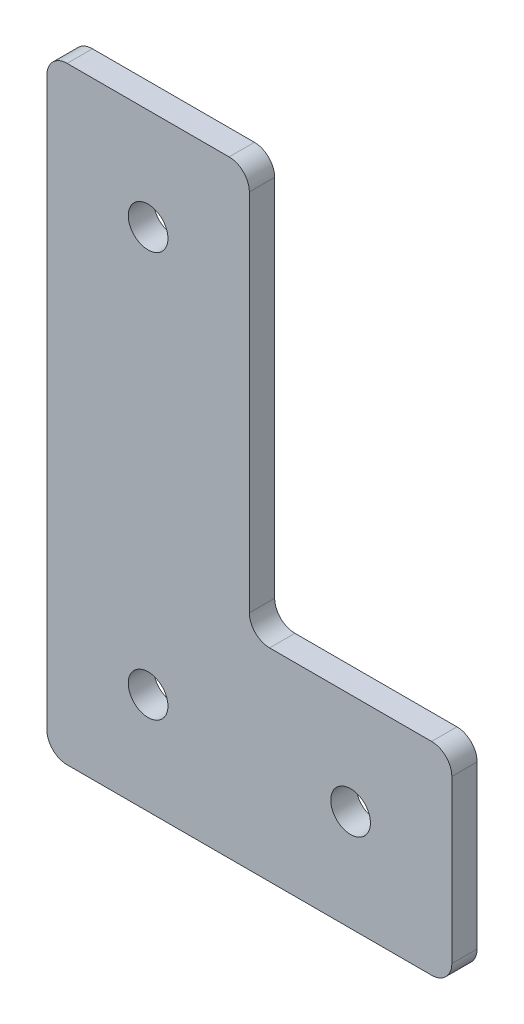
ISO-10303-21;
HEADER;
FILE_DESCRIPTION(('STEP AP214'),'2;1');
FILE_NAME('part.step','',(''),(''),'','','');
FILE_SCHEMA(('AUTOMOTIVE_DESIGN { 1 0 10303 214 1 1 1 1 }'));
ENDSEC;
DATA;
#1=APPLICATION_CONTEXT('core data for automotive mechanical design processes');
#2=APPLICATION_PROTOCOL_DEFINITION('international standard','automotive_design',2000,#1);
#3=PRODUCT_CONTEXT('',#1,'mechanical');
#4=PRODUCT('Part','Part','',(#3));
#5=PRODUCT_RELATED_PRODUCT_CATEGORY('part','',(#4));
#6=PRODUCT_DEFINITION_FORMATION('','',#4);
#7=PRODUCT_DEFINITION_CONTEXT('part definition',#1,'design');
#8=PRODUCT_DEFINITION('design','',#6,#7);
#9=PRODUCT_DEFINITION_SHAPE('','',#8);
#10=(LENGTH_UNIT() NAMED_UNIT(*) SI_UNIT(.MILLI.,.METRE.));
#11=(NAMED_UNIT(*) PLANE_ANGLE_UNIT() SI_UNIT($,.RADIAN.));
#12=(NAMED_UNIT(*) SI_UNIT($,.STERADIAN.) SOLID_ANGLE_UNIT());
#13=UNCERTAINTY_MEASURE_WITH_UNIT(LENGTH_MEASURE(1.E-05),#10,'distance_accuracy_value','');
#14=(GEOMETRIC_REPRESENTATION_CONTEXT(3) GLOBAL_UNCERTAINTY_ASSIGNED_CONTEXT((#13)) GLOBAL_UNIT_ASSIGNED_CONTEXT((#10,
#11,#12)) REPRESENTATION_CONTEXT('',''));
#15=CARTESIAN_POINT('',(0.,0.,0.));
#16=DIRECTION('',(0.,0.,1.));
#17=DIRECTION('',(1.,0.,0.));
#18=AXIS2_PLACEMENT_3D('',#15,#16,#17);
#19=CARTESIAN_POINT('',(48.26,2.54,3.175));
#20=DIRECTION('',(0.,0.,1.));
#21=DIRECTION('',(1.,0.,0.));
#22=AXIS2_PLACEMENT_3D('',#19,#20,#21);
#23=PLANE('',#22);
#24=CARTESIAN_POINT('',(12.7,12.7,3.175));
#25=DIRECTION('',(0.,0.,1.));
#26=DIRECTION('',(1.,0.,0.));
#27=AXIS2_PLACEMENT_3D('',#24,#25,#26);
#28=CIRCLE('',#27,2.4892);
#29=CARTESIAN_POINT('',(15.1892,12.7,3.175));
#30=VERTEX_POINT('',#29);
#31=EDGE_CURVE('E286',#30,#30,#28,.T.);
#32=ORIENTED_EDGE('',*,*,#31,.F.);
#33=EDGE_LOOP('',(#32));
#34=FACE_BOUND('',#33,.T.);
#35=CARTESIAN_POINT('',(48.26,2.54,3.175));
#36=DIRECTION('',(0.,0.,1.));
#37=DIRECTION('',(1.,0.,0.));
#38=AXIS2_PLACEMENT_3D('',#35,#36,#37);
#39=CIRCLE('',#38,2.54);
#40=CARTESIAN_POINT('',(48.26,0.,3.175));
#41=VERTEX_POINT('',#40);
#42=CARTESIAN_POINT('',(50.8,2.54000000000002,3.175));
#43=VERTEX_POINT('',#42);
#44=EDGE_CURVE('E177',#41,#43,#39,.T.);
#45=ORIENTED_EDGE('',*,*,#44,.T.);
#46=DIRECTION('',(0.,1.,0.));
#47=VECTOR('',#46,1.);
#48=CARTESIAN_POINT('',(50.8,2.54000000000002,3.175));
#49=LINE('',#48,#47);
#50=CARTESIAN_POINT('',(50.8,22.86,3.175));
#51=VERTEX_POINT('',#50);
#52=EDGE_CURVE('E105',#43,#51,#49,.T.);
#53=ORIENTED_EDGE('',*,*,#52,.T.);
#54=CARTESIAN_POINT('',(48.26,22.86,3.175));
#55=DIRECTION('',(0.,0.,1.));
#56=DIRECTION('',(1.,0.,0.));
#57=AXIS2_PLACEMENT_3D('',#54,#55,#56);
#58=CIRCLE('',#57,2.54);
#59=CARTESIAN_POINT('',(48.26,25.4,3.175));
#60=VERTEX_POINT('',#59);
#61=EDGE_CURVE('E204',#51,#60,#58,.T.);
#62=ORIENTED_EDGE('',*,*,#61,.T.);
#63=DIRECTION('',(-1.,0.,0.));
#64=VECTOR('',#63,1.);
#65=CARTESIAN_POINT('',(48.26,25.4,3.175));
#66=LINE('',#65,#64);
#67=CARTESIAN_POINT('',(27.94,25.4,3.175));
#68=VERTEX_POINT('',#67);
#69=EDGE_CURVE('E223',#60,#68,#66,.T.);
#70=ORIENTED_EDGE('',*,*,#69,.T.);
#71=CARTESIAN_POINT('',(27.94,27.94,3.175));
#72=DIRECTION('',(0.,0.,-1.));
#73=DIRECTION('',(-1.,0.,0.));
#74=AXIS2_PLACEMENT_3D('',#71,#72,#73);
#75=CIRCLE('',#74,2.54);
#76=CARTESIAN_POINT('',(25.4,27.94,3.175));
#77=VERTEX_POINT('',#76);
#78=EDGE_CURVE('E220',#68,#77,#75,.T.);
#79=ORIENTED_EDGE('',*,*,#78,.T.);
#80=DIRECTION('',(0.,1.,0.));
#81=VECTOR('',#80,1.);
#82=CARTESIAN_POINT('',(25.4,27.94,3.175));
#83=LINE('',#82,#81);
#84=CARTESIAN_POINT('',(25.4,73.66,3.175));
#85=VERTEX_POINT('',#84);
#86=EDGE_CURVE('E222',#77,#85,#83,.T.);
#87=ORIENTED_EDGE('',*,*,#86,.T.);
#88=CARTESIAN_POINT('',(22.86,73.66,3.175));
#89=DIRECTION('',(0.,0.,1.));
#90=DIRECTION('',(1.,0.,0.));
#91=AXIS2_PLACEMENT_3D('',#88,#89,#90);
#92=CIRCLE('',#91,2.54);
#93=CARTESIAN_POINT('',(22.86,76.2,3.175));
#94=VERTEX_POINT('',#93);
#95=EDGE_CURVE('E225',#85,#94,#92,.T.);
#96=ORIENTED_EDGE('',*,*,#95,.T.);
#97=DIRECTION('',(-1.,0.,0.));
#98=VECTOR('',#97,1.);
#99=CARTESIAN_POINT('',(22.86,76.2,3.175));
#100=LINE('',#99,#98);
#101=CARTESIAN_POINT('',(2.54000000000002,76.2,3.175));
#102=VERTEX_POINT('',#101);
#103=EDGE_CURVE('E231',#94,#102,#100,.T.);
#104=ORIENTED_EDGE('',*,*,#103,.T.);
#105=CARTESIAN_POINT('',(2.54,73.66,3.175));
#106=DIRECTION('',(0.,0.,1.));
#107=DIRECTION('',(-1.,0.,0.));
#108=AXIS2_PLACEMENT_3D('',#105,#106,#107);
#109=CIRCLE('',#108,2.54);
#110=CARTESIAN_POINT('',(0.,73.66,3.175));
#111=VERTEX_POINT('',#110);
#112=EDGE_CURVE('E136',#102,#111,#109,.T.);
#113=ORIENTED_EDGE('',*,*,#112,.T.);
#114=DIRECTION('',(0.,-1.,0.));
#115=VECTOR('',#114,1.);
#116=CARTESIAN_POINT('',(0.,73.66,3.175));
#117=LINE('',#116,#115);
#118=CARTESIAN_POINT('',(0.,2.54000000000002,3.175));
#119=VERTEX_POINT('',#118);
#120=EDGE_CURVE('E130',#111,#119,#117,.T.);
#121=ORIENTED_EDGE('',*,*,#120,.T.);
#122=CARTESIAN_POINT('',(2.54,2.54,3.175));
#123=DIRECTION('',(0.,0.,1.));
#124=DIRECTION('',(1.,0.,0.));
#125=AXIS2_PLACEMENT_3D('',#122,#123,#124);
#126=CIRCLE('',#125,2.54);
#127=CARTESIAN_POINT('',(2.54000000000002,0.,3.175));
#128=VERTEX_POINT('',#127);
#129=EDGE_CURVE('E134',#119,#128,#126,.T.);
#130=ORIENTED_EDGE('',*,*,#129,.T.);
#131=DIRECTION('',(1.,0.,0.));
#132=VECTOR('',#131,1.);
#133=CARTESIAN_POINT('',(2.54000000000002,0.,3.175));
#134=LINE('',#133,#132);
#135=EDGE_CURVE('E50',#128,#41,#134,.T.);
#136=ORIENTED_EDGE('',*,*,#135,.T.);
#137=EDGE_LOOP('',(#45,#53,#62,#70,#79,#87,#96,#104,#113,#121,#130,#136));
#138=FACE_BOUND('',#137,.T.);
#139=CARTESIAN_POINT('',(12.7,63.5,3.175));
#140=DIRECTION('',(0.,0.,1.));
#141=DIRECTION('',(1.,0.,0.));
#142=AXIS2_PLACEMENT_3D('',#139,#140,#141);
#143=CIRCLE('',#142,2.4892);
#144=CARTESIAN_POINT('',(15.1892,63.5,3.175));
#145=VERTEX_POINT('',#144);
#146=EDGE_CURVE('E158',#145,#145,#143,.T.);
#147=ORIENTED_EDGE('',*,*,#146,.F.);
#148=EDGE_LOOP('',(#147));
#149=FACE_BOUND('',#148,.T.);
#150=CARTESIAN_POINT('',(38.1,12.7,3.175));
#151=DIRECTION('',(0.,0.,1.));
#152=DIRECTION('',(1.,0.,0.));
#153=AXIS2_PLACEMENT_3D('',#150,#151,#152);
#154=CIRCLE('',#153,2.4892);
#155=CARTESIAN_POINT('',(40.5892,12.7,3.175));
#156=VERTEX_POINT('',#155);
#157=EDGE_CURVE('E277',#156,#156,#154,.T.);
#158=ORIENTED_EDGE('',*,*,#157,.F.);
#159=EDGE_LOOP('',(#158));
#160=FACE_BOUND('',#159,.T.);
#161=ADVANCED_FACE('F33',(#34,#138,#149,#160),#23,.T.);
#162=CARTESIAN_POINT('',(48.26,2.54,0.));
#163=DIRECTION('',(0.,0.,1.));
#164=DIRECTION('',(1.,0.,0.));
#165=AXIS2_PLACEMENT_3D('',#162,#163,#164);
#166=PLANE('',#165);
#167=CARTESIAN_POINT('',(48.26,2.54,0.));
#168=DIRECTION('',(0.,0.,1.));
#169=DIRECTION('',(1.,0.,0.));
#170=AXIS2_PLACEMENT_3D('',#167,#168,#169);
#171=CIRCLE('',#170,2.54);
#172=CARTESIAN_POINT('',(48.26,0.,0.));
#173=VERTEX_POINT('',#172);
#174=CARTESIAN_POINT('',(50.8,2.54000000000002,0.));
#175=VERTEX_POINT('',#174);
#176=EDGE_CURVE('E154',#173,#175,#171,.T.);
#177=ORIENTED_EDGE('',*,*,#176,.F.);
#178=DIRECTION('',(1.,0.,0.));
#179=VECTOR('',#178,1.);
#180=CARTESIAN_POINT('',(2.54000000000002,0.,0.));
#181=LINE('',#180,#179);
#182=CARTESIAN_POINT('',(2.54000000000002,0.,0.));
#183=VERTEX_POINT('',#182);
#184=EDGE_CURVE('E97',#183,#173,#181,.T.);
#185=ORIENTED_EDGE('',*,*,#184,.F.);
#186=CARTESIAN_POINT('',(2.54,2.54,0.));
#187=DIRECTION('',(0.,0.,1.));
#188=DIRECTION('',(1.,0.,0.));
#189=AXIS2_PLACEMENT_3D('',#186,#187,#188);
#190=CIRCLE('',#189,2.54);
#191=CARTESIAN_POINT('',(0.,2.54000000000002,0.));
#192=VERTEX_POINT('',#191);
#193=EDGE_CURVE('E91',#192,#183,#190,.T.);
#194=ORIENTED_EDGE('',*,*,#193,.F.);
#195=DIRECTION('',(0.,-1.,0.));
#196=VECTOR('',#195,1.);
#197=CARTESIAN_POINT('',(0.,73.66,0.));
#198=LINE('',#197,#196);
#199=CARTESIAN_POINT('',(0.,73.66,0.));
#200=VERTEX_POINT('',#199);
#201=EDGE_CURVE('E144',#200,#192,#198,.T.);
#202=ORIENTED_EDGE('',*,*,#201,.F.);
#203=CARTESIAN_POINT('',(2.54,73.66,0.));
#204=DIRECTION('',(0.,0.,1.));
#205=DIRECTION('',(-1.,0.,0.));
#206=AXIS2_PLACEMENT_3D('',#203,#204,#205);
#207=CIRCLE('',#206,2.54);
#208=CARTESIAN_POINT('',(2.54000000000002,76.2,0.));
#209=VERTEX_POINT('',#208);
#210=EDGE_CURVE('E172',#209,#200,#207,.T.);
#211=ORIENTED_EDGE('',*,*,#210,.F.);
#212=DIRECTION('',(-1.,0.,0.));
#213=VECTOR('',#212,1.);
#214=CARTESIAN_POINT('',(22.86,76.2,0.));
#215=LINE('',#214,#213);
#216=CARTESIAN_POINT('',(22.86,76.2,0.));
#217=VERTEX_POINT('',#216);
#218=EDGE_CURVE('E170',#217,#209,#215,.T.);
#219=ORIENTED_EDGE('',*,*,#218,.F.);
#220=CARTESIAN_POINT('',(22.86,73.66,0.));
#221=DIRECTION('',(0.,0.,1.));
#222=DIRECTION('',(1.,0.,0.));
#223=AXIS2_PLACEMENT_3D('',#220,#221,#222);
#224=CIRCLE('',#223,2.54);
#225=CARTESIAN_POINT('',(25.4,73.66,0.));
#226=VERTEX_POINT('',#225);
#227=EDGE_CURVE('E168',#226,#217,#224,.T.);
#228=ORIENTED_EDGE('',*,*,#227,.F.);
#229=DIRECTION('',(0.,1.,0.));
#230=VECTOR('',#229,1.);
#231=CARTESIAN_POINT('',(25.4,27.94,0.));
#232=LINE('',#231,#230);
#233=CARTESIAN_POINT('',(25.4,27.94,0.));
#234=VERTEX_POINT('',#233);
#235=EDGE_CURVE('E166',#234,#226,#232,.T.);
#236=ORIENTED_EDGE('',*,*,#235,.F.);
#237=CARTESIAN_POINT('',(27.94,27.94,0.));
#238=DIRECTION('',(0.,0.,-1.));
#239=DIRECTION('',(-1.,0.,0.));
#240=AXIS2_PLACEMENT_3D('',#237,#238,#239);
#241=CIRCLE('',#240,2.54);
#242=CARTESIAN_POINT('',(27.94,25.4,0.));
#243=VERTEX_POINT('',#242);
#244=EDGE_CURVE('E164',#243,#234,#241,.T.);
#245=ORIENTED_EDGE('',*,*,#244,.F.);
#246=DIRECTION('',(-1.,0.,0.));
#247=VECTOR('',#246,1.);
#248=CARTESIAN_POINT('',(48.26,25.4,0.));
#249=LINE('',#248,#247);
#250=CARTESIAN_POINT('',(48.26,25.4,0.));
#251=VERTEX_POINT('',#250);
#252=EDGE_CURVE('E162',#251,#243,#249,.T.);
#253=ORIENTED_EDGE('',*,*,#252,.F.);
#254=CARTESIAN_POINT('',(48.26,22.86,0.));
#255=DIRECTION('',(0.,0.,1.));
#256=DIRECTION('',(1.,0.,0.));
#257=AXIS2_PLACEMENT_3D('',#254,#255,#256);
#258=CIRCLE('',#257,2.54);
#259=CARTESIAN_POINT('',(50.8,22.86,0.));
#260=VERTEX_POINT('',#259);
#261=EDGE_CURVE('E160',#260,#251,#258,.T.);
#262=ORIENTED_EDGE('',*,*,#261,.F.);
#263=DIRECTION('',(0.,1.,0.));
#264=VECTOR('',#263,1.);
#265=CARTESIAN_POINT('',(50.8,2.54000000000002,0.));
#266=LINE('',#265,#264);
#267=EDGE_CURVE('E157',#175,#260,#266,.T.);
#268=ORIENTED_EDGE('',*,*,#267,.F.);
#269=EDGE_LOOP('',(#177,#185,#194,#202,#211,#219,#228,#236,#245,#253,#262,#268));
#270=FACE_BOUND('',#269,.T.);
#271=CARTESIAN_POINT('',(12.7,63.5,0.));
#272=DIRECTION('',(0.,0.,1.));
#273=DIRECTION('',(1.,0.,0.));
#274=AXIS2_PLACEMENT_3D('',#271,#272,#273);
#275=CIRCLE('',#274,2.4892);
#276=CARTESIAN_POINT('',(15.1892,63.5,0.));
#277=VERTEX_POINT('',#276);
#278=EDGE_CURVE('E289',#277,#277,#275,.T.);
#279=ORIENTED_EDGE('',*,*,#278,.T.);
#280=EDGE_LOOP('',(#279));
#281=FACE_BOUND('',#280,.T.);
#282=CARTESIAN_POINT('',(12.7,12.7,0.));
#283=DIRECTION('',(0.,0.,1.));
#284=DIRECTION('',(1.,0.,0.));
#285=AXIS2_PLACEMENT_3D('',#282,#283,#284);
#286=CIRCLE('',#285,2.4892);
#287=CARTESIAN_POINT('',(15.1892,12.7,0.));
#288=VERTEX_POINT('',#287);
#289=EDGE_CURVE('E283',#288,#288,#286,.T.);
#290=ORIENTED_EDGE('',*,*,#289,.T.);
#291=EDGE_LOOP('',(#290));
#292=FACE_BOUND('',#291,.T.);
#293=CARTESIAN_POINT('',(38.1,12.7,0.));
#294=DIRECTION('',(0.,0.,1.));
#295=DIRECTION('',(1.,0.,0.));
#296=AXIS2_PLACEMENT_3D('',#293,#294,#295);
#297=CIRCLE('',#296,2.4892);
#298=CARTESIAN_POINT('',(40.5892,12.7,0.));
#299=VERTEX_POINT('',#298);
#300=EDGE_CURVE('E280',#299,#299,#297,.T.);
#301=ORIENTED_EDGE('',*,*,#300,.T.);
#302=EDGE_LOOP('',(#301));
#303=FACE_BOUND('',#302,.T.);
#304=ADVANCED_FACE('F208',(#270,#281,#292,#303),#166,.F.);
#305=CARTESIAN_POINT('',(48.26,2.54,3.175));
#306=DIRECTION('',(0.,0.,-1.));
#307=DIRECTION('',(-1.,0.,0.));
#308=AXIS2_PLACEMENT_3D('',#305,#306,#307);
#309=CYLINDRICAL_SURFACE('',#308,2.54);
#310=ORIENTED_EDGE('',*,*,#176,.T.);
#311=DIRECTION('',(0.,0.,-1.));
#312=VECTOR('',#311,1.);
#313=CARTESIAN_POINT('',(50.8,2.54000000000002,3.175));
#314=LINE('',#313,#312);
#315=EDGE_CURVE('E11',#43,#175,#314,.T.);
#316=ORIENTED_EDGE('',*,*,#315,.F.);
#317=ORIENTED_EDGE('',*,*,#44,.F.);
#318=DIRECTION('',(0.,0.,-1.));
#319=VECTOR('',#318,1.);
#320=CARTESIAN_POINT('',(48.26,0.,3.175));
#321=LINE('',#320,#319);
#322=EDGE_CURVE('E150',#41,#173,#321,.T.);
#323=ORIENTED_EDGE('',*,*,#322,.T.);
#324=EDGE_LOOP('',(#310,#316,#317,#323));
#325=FACE_BOUND('',#324,.T.);
#326=ADVANCED_FACE('F35',(#325),#309,.T.);
#327=CARTESIAN_POINT('',(50.8,2.54000000000002,3.175));
#328=DIRECTION('',(-1.,0.,0.));
#329=DIRECTION('',(0.,0.,1.));
#330=AXIS2_PLACEMENT_3D('',#327,#328,#329);
#331=PLANE('',#330);
#332=ORIENTED_EDGE('',*,*,#267,.T.);
#333=DIRECTION('',(0.,0.,-1.));
#334=VECTOR('',#333,1.);
#335=CARTESIAN_POINT('',(50.8,22.86,3.175));
#336=LINE('',#335,#334);
#337=EDGE_CURVE('E42',#51,#260,#336,.T.);
#338=ORIENTED_EDGE('',*,*,#337,.F.);
#339=ORIENTED_EDGE('',*,*,#52,.F.);
#340=ORIENTED_EDGE('',*,*,#315,.T.);
#341=EDGE_LOOP('',(#332,#338,#339,#340));
#342=FACE_BOUND('',#341,.T.);
#343=ADVANCED_FACE('F391',(#342),#331,.F.);
#344=CARTESIAN_POINT('',(48.26,22.86,3.175));
#345=DIRECTION('',(0.,0.,-1.));
#346=DIRECTION('',(-1.,0.,0.));
#347=AXIS2_PLACEMENT_3D('',#344,#345,#346);
#348=CYLINDRICAL_SURFACE('',#347,2.54);
#349=ORIENTED_EDGE('',*,*,#261,.T.);
#350=DIRECTION('',(0.,0.,-1.));
#351=VECTOR('',#350,1.);
#352=CARTESIAN_POINT('',(48.26,25.4,3.175));
#353=LINE('',#352,#351);
#354=EDGE_CURVE('E196',#60,#251,#353,.T.);
#355=ORIENTED_EDGE('',*,*,#354,.F.);
#356=ORIENTED_EDGE('',*,*,#61,.F.);
#357=ORIENTED_EDGE('',*,*,#337,.T.);
#358=EDGE_LOOP('',(#349,#355,#356,#357));
#359=FACE_BOUND('',#358,.T.);
#360=ADVANCED_FACE('F202',(#359),#348,.T.);
#361=CARTESIAN_POINT('',(48.26,25.4,3.175));
#362=DIRECTION('',(0.,-1.,0.));
#363=DIRECTION('',(1.,0.,0.));
#364=AXIS2_PLACEMENT_3D('',#361,#362,#363);
#365=PLANE('',#364);
#366=ORIENTED_EDGE('',*,*,#252,.T.);
#367=DIRECTION('',(0.,0.,-1.));
#368=VECTOR('',#367,1.);
#369=CARTESIAN_POINT('',(27.94,25.4,3.175));
#370=LINE('',#369,#368);
#371=EDGE_CURVE('E193',#68,#243,#370,.T.);
#372=ORIENTED_EDGE('',*,*,#371,.F.);
#373=ORIENTED_EDGE('',*,*,#69,.F.);
#374=ORIENTED_EDGE('',*,*,#354,.T.);
#375=EDGE_LOOP('',(#366,#372,#373,#374));
#376=FACE_BOUND('',#375,.T.);
#377=ADVANCED_FACE('F214',(#376),#365,.F.);
#378=CARTESIAN_POINT('',(27.94,27.94,3.175));
#379=DIRECTION('',(0.,0.,-1.));
#380=DIRECTION('',(-1.,0.,0.));
#381=AXIS2_PLACEMENT_3D('',#378,#379,#380);
#382=CYLINDRICAL_SURFACE('',#381,2.54);
#383=ORIENTED_EDGE('',*,*,#244,.T.);
#384=DIRECTION('',(0.,0.,-1.));
#385=VECTOR('',#384,1.);
#386=CARTESIAN_POINT('',(25.4,27.94,3.175));
#387=LINE('',#386,#385);
#388=EDGE_CURVE('E190',#77,#234,#387,.T.);
#389=ORIENTED_EDGE('',*,*,#388,.F.);
#390=ORIENTED_EDGE('',*,*,#78,.F.);
#391=ORIENTED_EDGE('',*,*,#371,.T.);
#392=EDGE_LOOP('',(#383,#389,#390,#391));
#393=FACE_BOUND('',#392,.T.);
#394=ADVANCED_FACE('F218',(#393),#382,.F.);
#395=CARTESIAN_POINT('',(25.4,27.94,3.175));
#396=DIRECTION('',(-1.,0.,0.));
#397=DIRECTION('',(0.,0.,1.));
#398=AXIS2_PLACEMENT_3D('',#395,#396,#397);
#399=PLANE('',#398);
#400=ORIENTED_EDGE('',*,*,#235,.T.);
#401=DIRECTION('',(0.,0.,-1.));
#402=VECTOR('',#401,1.);
#403=CARTESIAN_POINT('',(25.4,73.66,3.175));
#404=LINE('',#403,#402);
#405=EDGE_CURVE('E187',#85,#226,#404,.T.);
#406=ORIENTED_EDGE('',*,*,#405,.F.);
#407=ORIENTED_EDGE('',*,*,#86,.F.);
#408=ORIENTED_EDGE('',*,*,#388,.T.);
#409=EDGE_LOOP('',(#400,#406,#407,#408));
#410=FACE_BOUND('',#409,.T.);
#411=ADVANCED_FACE('F356',(#410),#399,.F.);
#412=CARTESIAN_POINT('',(22.86,73.66,3.175));
#413=DIRECTION('',(0.,0.,-1.));
#414=DIRECTION('',(-1.,0.,0.));
#415=AXIS2_PLACEMENT_3D('',#412,#413,#414);
#416=CYLINDRICAL_SURFACE('',#415,2.54);
#417=ORIENTED_EDGE('',*,*,#227,.T.);
#418=DIRECTION('',(0.,0.,-1.));
#419=VECTOR('',#418,1.);
#420=CARTESIAN_POINT('',(22.86,76.2,3.175));
#421=LINE('',#420,#419);
#422=EDGE_CURVE('E184',#94,#217,#421,.T.);
#423=ORIENTED_EDGE('',*,*,#422,.F.);
#424=ORIENTED_EDGE('',*,*,#95,.F.);
#425=ORIENTED_EDGE('',*,*,#405,.T.);
#426=EDGE_LOOP('',(#417,#423,#424,#425));
#427=FACE_BOUND('',#426,.T.);
#428=ADVANCED_FACE('F347',(#427),#416,.T.);
#429=CARTESIAN_POINT('',(22.86,76.2,3.175));
#430=DIRECTION('',(0.,-1.,0.));
#431=DIRECTION('',(0.,0.,-1.));
#432=AXIS2_PLACEMENT_3D('',#429,#430,#431);
#433=PLANE('',#432);
#434=ORIENTED_EDGE('',*,*,#218,.T.);
#435=DIRECTION('',(0.,0.,-1.));
#436=VECTOR('',#435,1.);
#437=CARTESIAN_POINT('',(2.54000000000002,76.2,3.175));
#438=LINE('',#437,#436);
#439=EDGE_CURVE('E181',#102,#209,#438,.T.);
#440=ORIENTED_EDGE('',*,*,#439,.F.);
#441=ORIENTED_EDGE('',*,*,#103,.F.);
#442=ORIENTED_EDGE('',*,*,#422,.T.);
#443=EDGE_LOOP('',(#434,#440,#441,#442));
#444=FACE_BOUND('',#443,.T.);
#445=ADVANCED_FACE('F237',(#444),#433,.F.);
#446=CARTESIAN_POINT('',(2.54,73.66,3.175));
#447=DIRECTION('',(0.,0.,-1.));
#448=DIRECTION('',(-1.,0.,0.));
#449=AXIS2_PLACEMENT_3D('',#446,#447,#448);
#450=CYLINDRICAL_SURFACE('',#449,2.54);
#451=ORIENTED_EDGE('',*,*,#210,.T.);
#452=DIRECTION('',(0.,0.,-1.));
#453=VECTOR('',#452,1.);
#454=CARTESIAN_POINT('',(0.,73.66,3.175));
#455=LINE('',#454,#453);
#456=EDGE_CURVE('E145',#111,#200,#455,.T.);
#457=ORIENTED_EDGE('',*,*,#456,.F.);
#458=ORIENTED_EDGE('',*,*,#112,.F.);
#459=ORIENTED_EDGE('',*,*,#439,.T.);
#460=EDGE_LOOP('',(#451,#457,#458,#459));
#461=FACE_BOUND('',#460,.T.);
#462=ADVANCED_FACE('F241',(#461),#450,.T.);
#463=CARTESIAN_POINT('',(0.,73.66,3.175));
#464=DIRECTION('',(1.,0.,0.));
#465=DIRECTION('',(0.,1.,0.));
#466=AXIS2_PLACEMENT_3D('',#463,#464,#465);
#467=PLANE('',#466);
#468=ORIENTED_EDGE('',*,*,#201,.T.);
#469=DIRECTION('',(0.,0.,-1.));
#470=VECTOR('',#469,1.);
#471=CARTESIAN_POINT('',(0.,2.54000000000002,3.175));
#472=LINE('',#471,#470);
#473=EDGE_CURVE('E141',#119,#192,#472,.T.);
#474=ORIENTED_EDGE('',*,*,#473,.F.);
#475=ORIENTED_EDGE('',*,*,#120,.F.);
#476=ORIENTED_EDGE('',*,*,#456,.T.);
#477=EDGE_LOOP('',(#468,#474,#475,#476));
#478=FACE_BOUND('',#477,.T.);
#479=ADVANCED_FACE('F142',(#478),#467,.F.);
#480=CARTESIAN_POINT('',(2.54,2.54,3.175));
#481=DIRECTION('',(0.,0.,-1.));
#482=DIRECTION('',(-1.,0.,0.));
#483=AXIS2_PLACEMENT_3D('',#480,#481,#482);
#484=CYLINDRICAL_SURFACE('',#483,2.54);
#485=ORIENTED_EDGE('',*,*,#193,.T.);
#486=DIRECTION('',(0.,0.,-1.));
#487=VECTOR('',#486,1.);
#488=CARTESIAN_POINT('',(2.54000000000002,0.,3.175));
#489=LINE('',#488,#487);
#490=EDGE_CURVE('E146',#128,#183,#489,.T.);
#491=ORIENTED_EDGE('',*,*,#490,.F.);
#492=ORIENTED_EDGE('',*,*,#129,.F.);
#493=ORIENTED_EDGE('',*,*,#473,.T.);
#494=EDGE_LOOP('',(#485,#491,#492,#493));
#495=FACE_BOUND('',#494,.T.);
#496=ADVANCED_FACE('F148',(#495),#484,.T.);
#497=CARTESIAN_POINT('',(2.54000000000002,0.,3.175));
#498=DIRECTION('',(0.,1.,0.));
#499=DIRECTION('',(0.,0.,1.));
#500=AXIS2_PLACEMENT_3D('',#497,#498,#499);
#501=PLANE('',#500);
#502=ORIENTED_EDGE('',*,*,#184,.T.);
#503=ORIENTED_EDGE('',*,*,#322,.F.);
#504=ORIENTED_EDGE('',*,*,#135,.F.);
#505=ORIENTED_EDGE('',*,*,#490,.T.);
#506=EDGE_LOOP('',(#502,#503,#504,#505));
#507=FACE_BOUND('',#506,.T.);
#508=ADVANCED_FACE('F245',(#507),#501,.F.);
#509=CARTESIAN_POINT('',(12.7,63.5,3.175));
#510=DIRECTION('',(0.,0.,-1.));
#511=DIRECTION('',(-1.,0.,0.));
#512=AXIS2_PLACEMENT_3D('',#509,#510,#511);
#513=CYLINDRICAL_SURFACE('',#512,2.4892);
#514=ORIENTED_EDGE('',*,*,#146,.T.);
#515=EDGE_LOOP('',(#514));
#516=FACE_BOUND('',#515,.T.);
#517=ORIENTED_EDGE('',*,*,#278,.F.);
#518=EDGE_LOOP('',(#517));
#519=FACE_BOUND('',#518,.T.);
#520=ADVANCED_FACE('F247',(#516,#519),#513,.F.);
#521=CARTESIAN_POINT('',(12.7,12.7,3.175));
#522=DIRECTION('',(0.,0.,-1.));
#523=DIRECTION('',(-1.,0.,0.));
#524=AXIS2_PLACEMENT_3D('',#521,#522,#523);
#525=CYLINDRICAL_SURFACE('',#524,2.4892);
#526=ORIENTED_EDGE('',*,*,#31,.T.);
#527=EDGE_LOOP('',(#526));
#528=FACE_BOUND('',#527,.T.);
#529=ORIENTED_EDGE('',*,*,#289,.F.);
#530=EDGE_LOOP('',(#529));
#531=FACE_BOUND('',#530,.T.);
#532=ADVANCED_FACE('F253',(#528,#531),#525,.F.);
#533=CARTESIAN_POINT('',(38.1,12.7,3.175));
#534=DIRECTION('',(0.,0.,-1.));
#535=DIRECTION('',(-1.,0.,0.));
#536=AXIS2_PLACEMENT_3D('',#533,#534,#535);
#537=CYLINDRICAL_SURFACE('',#536,2.4892);
#538=ORIENTED_EDGE('',*,*,#157,.T.);
#539=EDGE_LOOP('',(#538));
#540=FACE_BOUND('',#539,.T.);
#541=ORIENTED_EDGE('',*,*,#300,.F.);
#542=EDGE_LOOP('',(#541));
#543=FACE_BOUND('',#542,.T.);
#544=ADVANCED_FACE('F268',(#540,#543),#537,.F.);
#545=CLOSED_SHELL('',(#161,#304,#326,#343,#360,#377,#394,#411,#428,#445,#462,#479,#496,#508,
#520,#532,#544));
#546=MANIFOLD_SOLID_BREP('B2',#545);
#547=ADVANCED_BREP_SHAPE_REPRESENTATION('',(#18,#546),#14);
#548=SHAPE_DEFINITION_REPRESENTATION(#9,#547);
ENDSEC;
END-ISO-10303-21;
